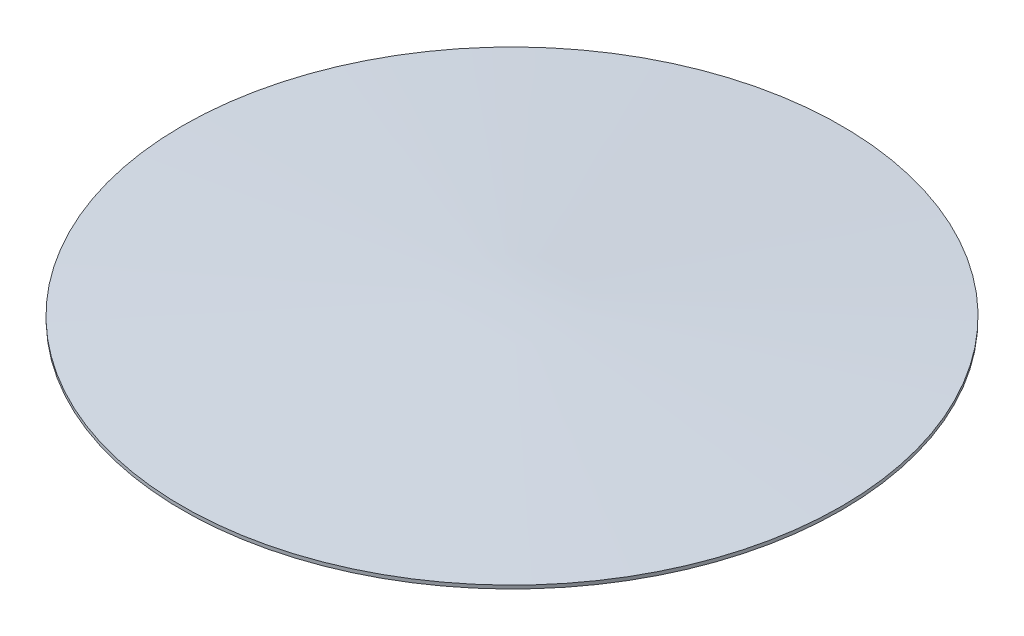
ISO-10303-21;
HEADER;
FILE_DESCRIPTION(('STEP AP214'),'2;1');
FILE_NAME('part.step','',(''),(''),'','','');
FILE_SCHEMA(('AUTOMOTIVE_DESIGN { 1 0 10303 214 1 1 1 1 }'));
ENDSEC;
DATA;
#1=APPLICATION_CONTEXT('core data for automotive mechanical design processes');
#2=APPLICATION_PROTOCOL_DEFINITION('international standard','automotive_design',2000,#1);
#3=PRODUCT_CONTEXT('',#1,'mechanical');
#4=PRODUCT('Part','Part','',(#3));
#5=PRODUCT_RELATED_PRODUCT_CATEGORY('part','',(#4));
#6=PRODUCT_DEFINITION_FORMATION('','',#4);
#7=PRODUCT_DEFINITION_CONTEXT('part definition',#1,'design');
#8=PRODUCT_DEFINITION('design','',#6,#7);
#9=PRODUCT_DEFINITION_SHAPE('','',#8);
#10=(LENGTH_UNIT() NAMED_UNIT(*) SI_UNIT(.MILLI.,.METRE.));
#11=(NAMED_UNIT(*) PLANE_ANGLE_UNIT() SI_UNIT($,.RADIAN.));
#12=(NAMED_UNIT(*) SI_UNIT($,.STERADIAN.) SOLID_ANGLE_UNIT());
#13=UNCERTAINTY_MEASURE_WITH_UNIT(LENGTH_MEASURE(1.E-05),#10,'distance_accuracy_value','');
#14=(GEOMETRIC_REPRESENTATION_CONTEXT(3) GLOBAL_UNCERTAINTY_ASSIGNED_CONTEXT((#13)) GLOBAL_UNIT_ASSIGNED_CONTEXT((#10,
#11,#12)) REPRESENTATION_CONTEXT('',''));
#15=CARTESIAN_POINT('',(0.,0.,0.));
#16=DIRECTION('',(0.,0.,1.));
#17=DIRECTION('',(1.,0.,0.));
#18=AXIS2_PLACEMENT_3D('',#15,#16,#17);
#19=CARTESIAN_POINT('',(0.,0.,0.));
#20=DIRECTION('',(0.,-1.,0.));
#21=DIRECTION('',(1.,0.,0.));
#22=AXIS2_PLACEMENT_3D('',#19,#20,#21);
#23=CONICAL_SURFACE('',#22,0.,1.51722832108146);
#24=CARTESIAN_POINT('',(0.,-10.,0.));
#25=DIRECTION('',(0.,-1.,0.));
#26=DIRECTION('',(1.,0.,0.));
#27=AXIS2_PLACEMENT_3D('',#24,#25,#26);
#28=CIRCLE('',#27,186.5);
#29=CARTESIAN_POINT('',(186.5,-10.,0.));
#30=VERTEX_POINT('',#29);
#31=EDGE_CURVE('E11',#30,#30,#28,.T.);
#32=ORIENTED_EDGE('',*,*,#31,.T.);
#33=EDGE_LOOP('',(#32));
#34=FACE_BOUND('',#33,.T.);
#35=CARTESIAN_POINT('',(0.,0.,0.));
#36=VERTEX_POINT('',#35);
#37=VERTEX_LOOP('',#36);
#38=FACE_BOUND('',#37,.T.);
#39=ADVANCED_FACE('F35',(#34,#38),#23,.F.);
#40=CARTESIAN_POINT('',(0.,-10.,0.));
#41=DIRECTION('',(0.,1.,0.));
#42=DIRECTION('',(-1.,0.,0.));
#43=AXIS2_PLACEMENT_3D('',#40,#41,#42);
#44=CONICAL_SURFACE('',#43,186.5,0.0535680057134334);
#45=CARTESIAN_POINT('',(0.,-8.00286884511762,0.));
#46=DIRECTION('',(0.,-1.,0.));
#47=DIRECTION('',(1.,0.,0.));
#48=AXIS2_PLACEMENT_3D('',#45,#46,#47);
#49=CIRCLE('',#48,186.607084780423);
#50=CARTESIAN_POINT('',(186.607084780423,-8.00286884511762,0.));
#51=VERTEX_POINT('',#50);
#52=EDGE_CURVE('E42',#51,#51,#49,.T.);
#53=ORIENTED_EDGE('',*,*,#52,.T.);
#54=EDGE_LOOP('',(#53));
#55=FACE_BOUND('',#54,.T.);
#56=ORIENTED_EDGE('',*,*,#31,.F.);
#57=EDGE_LOOP('',(#56));
#58=FACE_BOUND('',#57,.T.);
#59=ADVANCED_FACE('F51',(#55,#58),#44,.T.);
#60=CARTESIAN_POINT('',(0.,-8.00286884511762,0.));
#61=DIRECTION('',(0.,-1.,0.));
#62=DIRECTION('',(1.,0.,0.));
#63=AXIS2_PLACEMENT_3D('',#60,#61,#62);
#64=CONICAL_SURFACE('',#63,186.607084780423,1.51722832108146);
#65=CARTESIAN_POINT('',(0.,2.00287296616503,0.));
#66=VERTEX_POINT('',#65);
#67=VERTEX_LOOP('',#66);
#68=FACE_BOUND('',#67,.T.);
#69=ORIENTED_EDGE('',*,*,#52,.F.);
#70=EDGE_LOOP('',(#69));
#71=FACE_BOUND('',#70,.T.);
#72=ADVANCED_FACE('F48',(#68,#71),#64,.T.);
#73=CLOSED_SHELL('',(#39,#59,#72));
#74=MANIFOLD_SOLID_BREP('B2',#73);
#75=ADVANCED_BREP_SHAPE_REPRESENTATION('',(#18,#74),#14);
#76=SHAPE_DEFINITION_REPRESENTATION(#9,#75);
ENDSEC;
END-ISO-10303-21;
